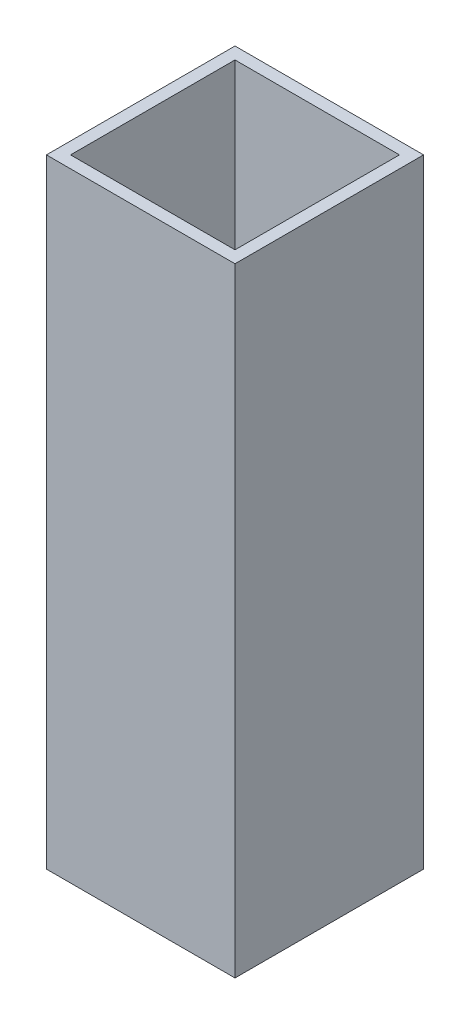
ISO-10303-21;
HEADER;
FILE_DESCRIPTION(('STEP AP214'),'2;1');
FILE_NAME('part.step','',(''),(''),'','','');
FILE_SCHEMA(('AUTOMOTIVE_DESIGN { 1 0 10303 214 1 1 1 1 }'));
ENDSEC;
DATA;
#1=APPLICATION_CONTEXT('core data for automotive mechanical design processes');
#2=APPLICATION_PROTOCOL_DEFINITION('international standard','automotive_design',2000,#1);
#3=PRODUCT_CONTEXT('',#1,'mechanical');
#4=PRODUCT('Part','Part','',(#3));
#5=PRODUCT_RELATED_PRODUCT_CATEGORY('part','',(#4));
#6=PRODUCT_DEFINITION_FORMATION('','',#4);
#7=PRODUCT_DEFINITION_CONTEXT('part definition',#1,'design');
#8=PRODUCT_DEFINITION('design','',#6,#7);
#9=PRODUCT_DEFINITION_SHAPE('','',#8);
#10=(LENGTH_UNIT() NAMED_UNIT(*) SI_UNIT(.MILLI.,.METRE.));
#11=(NAMED_UNIT(*) PLANE_ANGLE_UNIT() SI_UNIT($,.RADIAN.));
#12=(NAMED_UNIT(*) SI_UNIT($,.STERADIAN.) SOLID_ANGLE_UNIT());
#13=UNCERTAINTY_MEASURE_WITH_UNIT(LENGTH_MEASURE(1.E-05),#10,'distance_accuracy_value','');
#14=(GEOMETRIC_REPRESENTATION_CONTEXT(3) GLOBAL_UNCERTAINTY_ASSIGNED_CONTEXT((#13)) GLOBAL_UNIT_ASSIGNED_CONTEXT((#10,
#11,#12)) REPRESENTATION_CONTEXT('',''));
#15=CARTESIAN_POINT('',(0.,0.,0.));
#16=DIRECTION('',(0.,0.,1.));
#17=DIRECTION('',(1.,0.,0.));
#18=AXIS2_PLACEMENT_3D('',#15,#16,#17);
#19=CARTESIAN_POINT('',(-4.78603603603604,41.,-4.64527027027027));
#20=DIRECTION('',(1.,0.,0.));
#21=DIRECTION('',(0.,0.,-1.));
#22=AXIS2_PLACEMENT_3D('',#19,#20,#21);
#23=PLANE('',#22);
#24=DIRECTION('',(0.,0.,1.));
#25=VECTOR('',#24,1.);
#26=CARTESIAN_POINT('',(-4.78603603603604,0.,-4.64527027027027));
#27=LINE('',#26,#25);
#28=CARTESIAN_POINT('',(-4.78603603603604,0.,-4.64527027027027));
#29=VERTEX_POINT('',#28);
#30=CARTESIAN_POINT('',(-4.78603603603604,0.,7.85472972972973));
#31=VERTEX_POINT('',#30);
#32=EDGE_CURVE('E171',#29,#31,#27,.T.);
#33=ORIENTED_EDGE('',*,*,#32,.T.);
#34=DIRECTION('',(0.,-1.,0.));
#35=VECTOR('',#34,1.);
#36=CARTESIAN_POINT('',(-4.78603603603604,41.,7.85472972972973));
#37=LINE('',#36,#35);
#38=CARTESIAN_POINT('',(-4.78603603603604,41.,7.85472972972973));
#39=VERTEX_POINT('',#38);
#40=EDGE_CURVE('E11',#39,#31,#37,.T.);
#41=ORIENTED_EDGE('',*,*,#40,.F.);
#42=DIRECTION('',(0.,0.,1.));
#43=VECTOR('',#42,1.);
#44=CARTESIAN_POINT('',(-4.78603603603604,41.,-4.64527027027027));
#45=LINE('',#44,#43);
#46=CARTESIAN_POINT('',(-4.78603603603604,41.,-4.64527027027027));
#47=VERTEX_POINT('',#46);
#48=EDGE_CURVE('E160',#47,#39,#45,.T.);
#49=ORIENTED_EDGE('',*,*,#48,.F.);
#50=DIRECTION('',(0.,-1.,0.));
#51=VECTOR('',#50,1.);
#52=CARTESIAN_POINT('',(-4.78603603603604,41.,-4.64527027027027));
#53=LINE('',#52,#51);
#54=EDGE_CURVE('E170',#47,#29,#53,.T.);
#55=ORIENTED_EDGE('',*,*,#54,.T.);
#56=EDGE_LOOP('',(#33,#41,#49,#55));
#57=FACE_BOUND('',#56,.T.);
#58=ADVANCED_FACE('F43',(#57),#23,.F.);
#59=CARTESIAN_POINT('',(-4.78603603603604,41.,7.85472972972973));
#60=DIRECTION('',(0.,0.,-1.));
#61=DIRECTION('',(-1.,0.,0.));
#62=AXIS2_PLACEMENT_3D('',#59,#60,#61);
#63=PLANE('',#62);
#64=DIRECTION('',(1.,0.,0.));
#65=VECTOR('',#64,1.);
#66=CARTESIAN_POINT('',(-4.78603603603604,0.,7.85472972972973));
#67=LINE('',#66,#65);
#68=CARTESIAN_POINT('',(7.71396396396396,0.,7.85472972972973));
#69=VERTEX_POINT('',#68);
#70=EDGE_CURVE('E175',#31,#69,#67,.T.);
#71=ORIENTED_EDGE('',*,*,#70,.T.);
#72=DIRECTION('',(0.,-1.,0.));
#73=VECTOR('',#72,1.);
#74=CARTESIAN_POINT('',(7.71396396396396,41.,7.85472972972973));
#75=LINE('',#74,#73);
#76=CARTESIAN_POINT('',(7.71396396396396,41.,7.85472972972973));
#77=VERTEX_POINT('',#76);
#78=EDGE_CURVE('E51',#77,#69,#75,.T.);
#79=ORIENTED_EDGE('',*,*,#78,.F.);
#80=DIRECTION('',(1.,0.,0.));
#81=VECTOR('',#80,1.);
#82=CARTESIAN_POINT('',(-4.78603603603604,41.,7.85472972972973));
#83=LINE('',#82,#81);
#84=EDGE_CURVE('E95',#39,#77,#83,.T.);
#85=ORIENTED_EDGE('',*,*,#84,.F.);
#86=ORIENTED_EDGE('',*,*,#40,.T.);
#87=EDGE_LOOP('',(#71,#79,#85,#86));
#88=FACE_BOUND('',#87,.T.);
#89=ADVANCED_FACE('F210',(#88),#63,.F.);
#90=CARTESIAN_POINT('',(7.71396396396396,41.,-4.64527027027027));
#91=DIRECTION('',(-1.,0.,0.));
#92=DIRECTION('',(0.,0.,1.));
#93=AXIS2_PLACEMENT_3D('',#90,#91,#92);
#94=PLANE('',#93);
#95=DIRECTION('',(0.,0.,-1.));
#96=VECTOR('',#95,1.);
#97=CARTESIAN_POINT('',(7.71396396396396,0.,-4.64527027027027));
#98=LINE('',#97,#96);
#99=CARTESIAN_POINT('',(7.71396396396396,0.,-4.64527027027027));
#100=VERTEX_POINT('',#99);
#101=EDGE_CURVE('E178',#69,#100,#98,.T.);
#102=ORIENTED_EDGE('',*,*,#101,.T.);
#103=DIRECTION('',(0.,-1.,0.));
#104=VECTOR('',#103,1.);
#105=CARTESIAN_POINT('',(7.71396396396396,41.,-4.64527027027027));
#106=LINE('',#105,#104);
#107=CARTESIAN_POINT('',(7.71396396396396,41.,-4.64527027027027));
#108=VERTEX_POINT('',#107);
#109=EDGE_CURVE('E185',#108,#100,#106,.T.);
#110=ORIENTED_EDGE('',*,*,#109,.F.);
#111=DIRECTION('',(0.,0.,-1.));
#112=VECTOR('',#111,1.);
#113=CARTESIAN_POINT('',(7.71396396396396,41.,-4.64527027027027));
#114=LINE('',#113,#112);
#115=EDGE_CURVE('E165',#77,#108,#114,.T.);
#116=ORIENTED_EDGE('',*,*,#115,.F.);
#117=ORIENTED_EDGE('',*,*,#78,.T.);
#118=EDGE_LOOP('',(#102,#110,#116,#117));
#119=FACE_BOUND('',#118,.T.);
#120=ADVANCED_FACE('F192',(#119),#94,.F.);
#121=CARTESIAN_POINT('',(-4.78603603603604,41.,-4.64527027027027));
#122=DIRECTION('',(0.,0.,1.));
#123=DIRECTION('',(1.,0.,0.));
#124=AXIS2_PLACEMENT_3D('',#121,#122,#123);
#125=PLANE('',#124);
#126=DIRECTION('',(-1.,0.,0.));
#127=VECTOR('',#126,1.);
#128=CARTESIAN_POINT('',(-4.78603603603604,0.,-4.64527027027027));
#129=LINE('',#128,#127);
#130=EDGE_CURVE('E88',#100,#29,#129,.T.);
#131=ORIENTED_EDGE('',*,*,#130,.T.);
#132=ORIENTED_EDGE('',*,*,#54,.F.);
#133=DIRECTION('',(-1.,0.,0.));
#134=VECTOR('',#133,1.);
#135=CARTESIAN_POINT('',(-4.78603603603604,41.,-4.64527027027027));
#136=LINE('',#135,#134);
#137=EDGE_CURVE('E67',#108,#47,#136,.T.);
#138=ORIENTED_EDGE('',*,*,#137,.F.);
#139=ORIENTED_EDGE('',*,*,#109,.T.);
#140=EDGE_LOOP('',(#131,#132,#138,#139));
#141=FACE_BOUND('',#140,.T.);
#142=ADVANCED_FACE('F200',(#141),#125,.F.);
#143=CARTESIAN_POINT('',(0.,41.,0.));
#144=DIRECTION('',(0.,1.,0.));
#145=DIRECTION('',(0.,0.,1.));
#146=AXIS2_PLACEMENT_3D('',#143,#144,#145);
#147=PLANE('',#146);
#148=DIRECTION('',(0.,0.,1.));
#149=VECTOR('',#148,1.);
#150=CARTESIAN_POINT('',(-3.98603603603604,41.,-4.64527027027027));
#151=LINE('',#150,#149);
#152=CARTESIAN_POINT('',(-3.98603603603604,41.,-3.84527027027027));
#153=VERTEX_POINT('',#152);
#154=CARTESIAN_POINT('',(-3.98603603603604,41.,7.05472972972973));
#155=VERTEX_POINT('',#154);
#156=EDGE_CURVE('E144',#153,#155,#151,.T.);
#157=ORIENTED_EDGE('',*,*,#156,.F.);
#158=DIRECTION('',(-1.,0.,0.));
#159=VECTOR('',#158,1.);
#160=CARTESIAN_POINT('',(-4.78603603603604,41.,-3.84527027027027));
#161=LINE('',#160,#159);
#162=CARTESIAN_POINT('',(6.91396396396396,41.,-3.84527027027027));
#163=VERTEX_POINT('',#162);
#164=EDGE_CURVE('E157',#163,#153,#161,.T.);
#165=ORIENTED_EDGE('',*,*,#164,.F.);
#166=DIRECTION('',(0.,0.,-1.));
#167=VECTOR('',#166,1.);
#168=CARTESIAN_POINT('',(6.91396396396396,41.,-4.64527027027027));
#169=LINE('',#168,#167);
#170=CARTESIAN_POINT('',(6.91396396396396,41.,7.05472972972973));
#171=VERTEX_POINT('',#170);
#172=EDGE_CURVE('E154',#171,#163,#169,.T.);
#173=ORIENTED_EDGE('',*,*,#172,.F.);
#174=DIRECTION('',(1.,0.,0.));
#175=VECTOR('',#174,1.);
#176=CARTESIAN_POINT('',(-4.78603603603604,41.,7.05472972972973));
#177=LINE('',#176,#175);
#178=EDGE_CURVE('E133',#155,#171,#177,.T.);
#179=ORIENTED_EDGE('',*,*,#178,.F.);
#180=EDGE_LOOP('',(#157,#165,#173,#179));
#181=FACE_BOUND('',#180,.T.);
#182=ORIENTED_EDGE('',*,*,#48,.T.);
#183=ORIENTED_EDGE('',*,*,#84,.T.);
#184=ORIENTED_EDGE('',*,*,#115,.T.);
#185=ORIENTED_EDGE('',*,*,#137,.T.);
#186=EDGE_LOOP('',(#182,#183,#184,#185));
#187=FACE_BOUND('',#186,.T.);
#188=ADVANCED_FACE('F202',(#181,#187),#147,.T.);
#189=CARTESIAN_POINT('',(0.,0.,0.));
#190=DIRECTION('',(0.,1.,0.));
#191=DIRECTION('',(0.,0.,1.));
#192=AXIS2_PLACEMENT_3D('',#189,#190,#191);
#193=PLANE('',#192);
#194=ORIENTED_EDGE('',*,*,#32,.F.);
#195=ORIENTED_EDGE('',*,*,#130,.F.);
#196=ORIENTED_EDGE('',*,*,#101,.F.);
#197=ORIENTED_EDGE('',*,*,#70,.F.);
#198=EDGE_LOOP('',(#194,#195,#196,#197));
#199=FACE_BOUND('',#198,.T.);
#200=ADVANCED_FACE('F196',(#199),#193,.F.);
#201=CARTESIAN_POINT('',(-3.98603603603604,41.,-4.64527027027027));
#202=DIRECTION('',(1.,0.,0.));
#203=DIRECTION('',(0.,0.,-1.));
#204=AXIS2_PLACEMENT_3D('',#201,#202,#203);
#205=PLANE('',#204);
#206=DIRECTION('',(0.,0.,1.));
#207=VECTOR('',#206,1.);
#208=CARTESIAN_POINT('',(-3.98603603603604,0.800000000000002,-4.64527027027027));
#209=LINE('',#208,#207);
#210=CARTESIAN_POINT('',(-3.98603603603604,0.8,-3.84527027027027));
#211=VERTEX_POINT('',#210);
#212=CARTESIAN_POINT('',(-3.98603603603604,0.8,7.05472972972973));
#213=VERTEX_POINT('',#212);
#214=EDGE_CURVE('E123',#211,#213,#209,.T.);
#215=ORIENTED_EDGE('',*,*,#214,.F.);
#216=DIRECTION('',(0.,-1.,0.));
#217=VECTOR('',#216,1.);
#218=CARTESIAN_POINT('',(-3.98603603603604,41.,-3.84527027027027));
#219=LINE('',#218,#217);
#220=EDGE_CURVE('E148',#153,#211,#219,.T.);
#221=ORIENTED_EDGE('',*,*,#220,.F.);
#222=ORIENTED_EDGE('',*,*,#156,.T.);
#223=DIRECTION('',(0.,-1.,0.));
#224=VECTOR('',#223,1.);
#225=CARTESIAN_POINT('',(-3.98603603603604,41.,7.05472972972973));
#226=LINE('',#225,#224);
#227=EDGE_CURVE('E137',#155,#213,#226,.T.);
#228=ORIENTED_EDGE('',*,*,#227,.T.);
#229=EDGE_LOOP('',(#215,#221,#222,#228));
#230=FACE_BOUND('',#229,.T.);
#231=ADVANCED_FACE('F239',(#230),#205,.T.);
#232=CARTESIAN_POINT('',(-4.78603603603604,41.,7.05472972972973));
#233=DIRECTION('',(0.,0.,-1.));
#234=DIRECTION('',(-1.,0.,0.));
#235=AXIS2_PLACEMENT_3D('',#232,#233,#234);
#236=PLANE('',#235);
#237=DIRECTION('',(1.,0.,0.));
#238=VECTOR('',#237,1.);
#239=CARTESIAN_POINT('',(-4.78603603603604,0.800000000000002,7.05472972972973));
#240=LINE('',#239,#238);
#241=CARTESIAN_POINT('',(6.91396396396396,0.8,7.05472972972973));
#242=VERTEX_POINT('',#241);
#243=EDGE_CURVE('E117',#213,#242,#240,.T.);
#244=ORIENTED_EDGE('',*,*,#243,.F.);
#245=ORIENTED_EDGE('',*,*,#227,.F.);
#246=ORIENTED_EDGE('',*,*,#178,.T.);
#247=DIRECTION('',(0.,-1.,0.));
#248=VECTOR('',#247,1.);
#249=CARTESIAN_POINT('',(6.91396396396396,41.,7.05472972972973));
#250=LINE('',#249,#248);
#251=EDGE_CURVE('E130',#171,#242,#250,.T.);
#252=ORIENTED_EDGE('',*,*,#251,.T.);
#253=EDGE_LOOP('',(#244,#245,#246,#252));
#254=FACE_BOUND('',#253,.T.);
#255=ADVANCED_FACE('F131',(#254),#236,.T.);
#256=CARTESIAN_POINT('',(6.91396396396396,41.,-4.64527027027027));
#257=DIRECTION('',(-1.,0.,0.));
#258=DIRECTION('',(0.,0.,1.));
#259=AXIS2_PLACEMENT_3D('',#256,#257,#258);
#260=PLANE('',#259);
#261=DIRECTION('',(0.,0.,-1.));
#262=VECTOR('',#261,1.);
#263=CARTESIAN_POINT('',(6.91396396396396,0.800000000000002,-4.64527027027027));
#264=LINE('',#263,#262);
#265=CARTESIAN_POINT('',(6.91396396396396,0.8,-3.84527027027027));
#266=VERTEX_POINT('',#265);
#267=EDGE_CURVE('E121',#242,#266,#264,.T.);
#268=ORIENTED_EDGE('',*,*,#267,.F.);
#269=ORIENTED_EDGE('',*,*,#251,.F.);
#270=ORIENTED_EDGE('',*,*,#172,.T.);
#271=DIRECTION('',(0.,-1.,0.));
#272=VECTOR('',#271,1.);
#273=CARTESIAN_POINT('',(6.91396396396396,41.,-3.84527027027027));
#274=LINE('',#273,#272);
#275=EDGE_CURVE('E58',#163,#266,#274,.T.);
#276=ORIENTED_EDGE('',*,*,#275,.T.);
#277=EDGE_LOOP('',(#268,#269,#270,#276));
#278=FACE_BOUND('',#277,.T.);
#279=ADVANCED_FACE('F139',(#278),#260,.T.);
#280=CARTESIAN_POINT('',(-4.78603603603604,41.,-3.84527027027027));
#281=DIRECTION('',(0.,0.,1.));
#282=DIRECTION('',(1.,0.,0.));
#283=AXIS2_PLACEMENT_3D('',#280,#281,#282);
#284=PLANE('',#283);
#285=DIRECTION('',(-1.,0.,0.));
#286=VECTOR('',#285,1.);
#287=CARTESIAN_POINT('',(-4.78603603603604,0.800000000000002,-3.84527027027027));
#288=LINE('',#287,#286);
#289=EDGE_CURVE('E141',#266,#211,#288,.T.);
#290=ORIENTED_EDGE('',*,*,#289,.F.);
#291=ORIENTED_EDGE('',*,*,#275,.F.);
#292=ORIENTED_EDGE('',*,*,#164,.T.);
#293=ORIENTED_EDGE('',*,*,#220,.T.);
#294=EDGE_LOOP('',(#290,#291,#292,#293));
#295=FACE_BOUND('',#294,.T.);
#296=ADVANCED_FACE('F273',(#295),#284,.T.);
#297=CARTESIAN_POINT('',(0.,0.8,0.));
#298=DIRECTION('',(0.,1.,0.));
#299=DIRECTION('',(0.,0.,1.));
#300=AXIS2_PLACEMENT_3D('',#297,#298,#299);
#301=PLANE('',#300);
#302=ORIENTED_EDGE('',*,*,#214,.T.);
#303=ORIENTED_EDGE('',*,*,#243,.T.);
#304=ORIENTED_EDGE('',*,*,#267,.T.);
#305=ORIENTED_EDGE('',*,*,#289,.T.);
#306=EDGE_LOOP('',(#302,#303,#304,#305));
#307=FACE_BOUND('',#306,.T.);
#308=ADVANCED_FACE('F119',(#307),#301,.T.);
#309=CLOSED_SHELL('',(#58,#89,#120,#142,#188,#200,#231,#255,#279,#296,#308));
#310=MANIFOLD_SOLID_BREP('B2',#309);
#311=ADVANCED_BREP_SHAPE_REPRESENTATION('',(#18,#310),#14);
#312=SHAPE_DEFINITION_REPRESENTATION(#9,#311);
ENDSEC;
END-ISO-10303-21;
